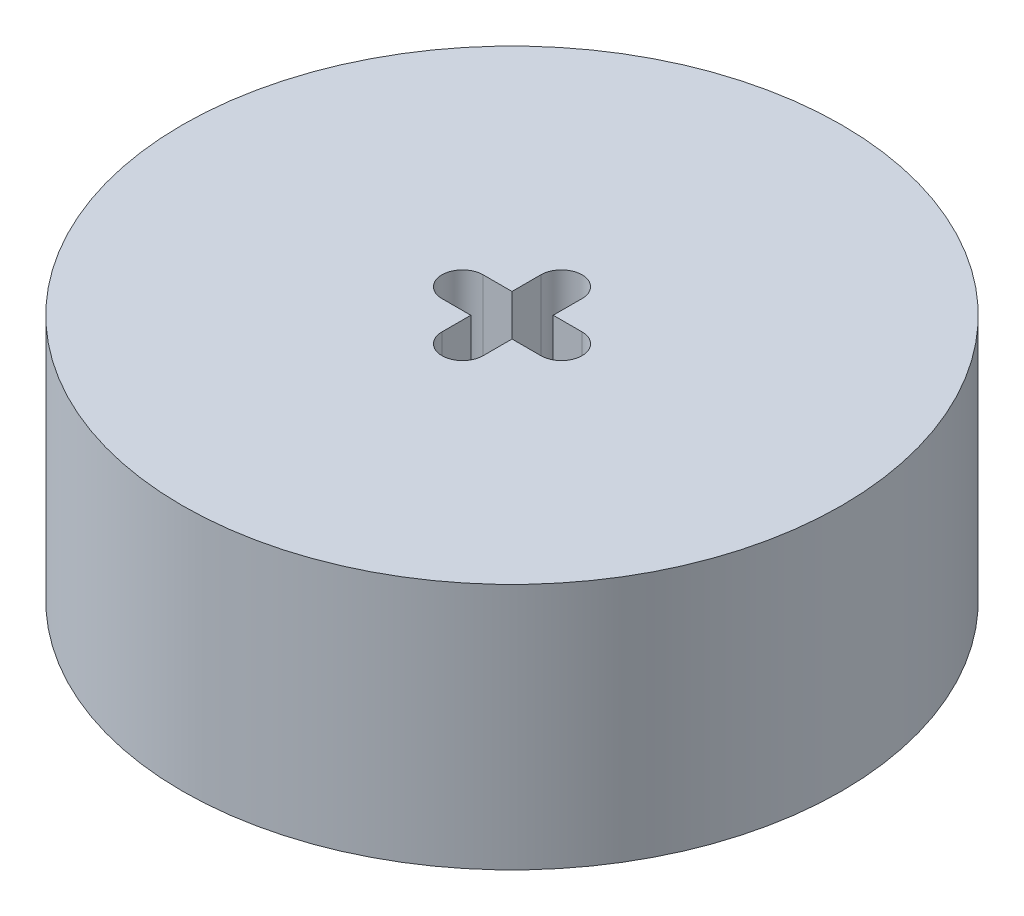
ISO-10303-21;
HEADER;
FILE_DESCRIPTION(('STEP AP214'),'2;1');
FILE_NAME('part.step','',(''),(''),'','','');
FILE_SCHEMA(('AUTOMOTIVE_DESIGN { 1 0 10303 214 1 1 1 1 }'));
ENDSEC;
DATA;
#1=APPLICATION_CONTEXT('core data for automotive mechanical design processes');
#2=APPLICATION_PROTOCOL_DEFINITION('international standard','automotive_design',2000,#1);
#3=PRODUCT_CONTEXT('',#1,'mechanical');
#4=PRODUCT('Part','Part','',(#3));
#5=PRODUCT_RELATED_PRODUCT_CATEGORY('part','',(#4));
#6=PRODUCT_DEFINITION_FORMATION('','',#4);
#7=PRODUCT_DEFINITION_CONTEXT('part definition',#1,'design');
#8=PRODUCT_DEFINITION('design','',#6,#7);
#9=PRODUCT_DEFINITION_SHAPE('','',#8);
#10=(LENGTH_UNIT() NAMED_UNIT(*) SI_UNIT(.MILLI.,.METRE.));
#11=(NAMED_UNIT(*) PLANE_ANGLE_UNIT() SI_UNIT($,.RADIAN.));
#12=(NAMED_UNIT(*) SI_UNIT($,.STERADIAN.) SOLID_ANGLE_UNIT());
#13=UNCERTAINTY_MEASURE_WITH_UNIT(LENGTH_MEASURE(1.E-05),#10,'distance_accuracy_value','');
#14=(GEOMETRIC_REPRESENTATION_CONTEXT(3) GLOBAL_UNCERTAINTY_ASSIGNED_CONTEXT((#13)) GLOBAL_UNIT_ASSIGNED_CONTEXT((#10,
#11,#12)) REPRESENTATION_CONTEXT('',''));
#15=CARTESIAN_POINT('',(0.,0.,0.));
#16=DIRECTION('',(0.,0.,1.));
#17=DIRECTION('',(1.,0.,0.));
#18=AXIS2_PLACEMENT_3D('',#15,#16,#17);
#19=CARTESIAN_POINT('',(0.,38.1,0.));
#20=DIRECTION('',(0.,1.,0.));
#21=DIRECTION('',(0.,0.,1.));
#22=AXIS2_PLACEMENT_3D('',#19,#20,#21);
#23=PLANE('',#22);
#24=DIRECTION('',(-1.,0.,0.));
#25=VECTOR('',#24,1.);
#26=CARTESIAN_POINT('',(0.,38.1,-3.17400000000062));
#27=LINE('',#26,#25);
#28=CARTESIAN_POINT('',(-3.175,38.1,-3.17400000000064));
#29=VERTEX_POINT('',#28);
#30=CARTESIAN_POINT('',(-7.61899999999997,38.1,-3.17400000000072));
#31=VERTEX_POINT('',#30);
#32=EDGE_CURVE('E54',#29,#31,#27,.T.);
#33=ORIENTED_EDGE('',*,*,#32,.F.);
#34=DIRECTION('',(0.,0.,-1.));
#35=VECTOR('',#34,1.);
#36=CARTESIAN_POINT('',(-3.175,38.1,0.));
#37=LINE('',#36,#35);
#38=CARTESIAN_POINT('',(-3.175,38.1,-7.62000000060629));
#39=VERTEX_POINT('',#38);
#40=EDGE_CURVE('E148',#29,#39,#37,.T.);
#41=ORIENTED_EDGE('',*,*,#40,.T.);
#42=CARTESIAN_POINT('',(0.,38.1,-7.62));
#43=DIRECTION('',(0.,1.,0.));
#44=DIRECTION('',(0.,0.,1.));
#45=AXIS2_PLACEMENT_3D('',#42,#43,#44);
#46=CIRCLE('',#45,3.175);
#47=CARTESIAN_POINT('',(3.175,38.1,-7.62));
#48=VERTEX_POINT('',#47);
#49=EDGE_CURVE('E154',#48,#39,#46,.T.);
#50=ORIENTED_EDGE('',*,*,#49,.F.);
#51=DIRECTION('',(0.,0.,-1.));
#52=VECTOR('',#51,1.);
#53=CARTESIAN_POINT('',(3.175,38.1,0.));
#54=LINE('',#53,#52);
#55=CARTESIAN_POINT('',(3.175,38.1,-3.17600000000064));
#56=VERTEX_POINT('',#55);
#57=EDGE_CURVE('E221',#56,#48,#54,.T.);
#58=ORIENTED_EDGE('',*,*,#57,.F.);
#59=DIRECTION('',(1.,0.,0.));
#60=VECTOR('',#59,1.);
#61=CARTESIAN_POINT('',(0.,38.1,-3.17600000000064));
#62=LINE('',#61,#60);
#63=CARTESIAN_POINT('',(7.62099999999846,38.1,-3.17600000000064));
#64=VERTEX_POINT('',#63);
#65=EDGE_CURVE('E217',#56,#64,#62,.T.);
#66=ORIENTED_EDGE('',*,*,#65,.T.);
#67=CARTESIAN_POINT('',(7.621,38.1,-0.00100000000063407));
#68=DIRECTION('',(0.,1.,0.));
#69=DIRECTION('',(0.,0.,1.));
#70=AXIS2_PLACEMENT_3D('',#67,#68,#69);
#71=CIRCLE('',#70,3.175);
#72=CARTESIAN_POINT('',(7.62099999999999,38.1,3.17399999999937));
#73=VERTEX_POINT('',#72);
#74=EDGE_CURVE('E213',#73,#64,#71,.T.);
#75=ORIENTED_EDGE('',*,*,#74,.F.);
#76=DIRECTION('',(1.,0.,0.));
#77=VECTOR('',#76,1.);
#78=CARTESIAN_POINT('',(0.,38.1,3.17399999999937));
#79=LINE('',#78,#77);
#80=CARTESIAN_POINT('',(3.17700000000044,38.1,3.17399999999937));
#81=VERTEX_POINT('',#80);
#82=EDGE_CURVE('E209',#81,#73,#79,.T.);
#83=ORIENTED_EDGE('',*,*,#82,.F.);
#84=DIRECTION('',(0.,0.,1.));
#85=VECTOR('',#84,1.);
#86=CARTESIAN_POINT('',(3.17700000000044,38.1,0.));
#87=LINE('',#86,#85);
#88=CARTESIAN_POINT('',(3.17700000000044,38.1,7.62000000000424));
#89=VERTEX_POINT('',#88);
#90=EDGE_CURVE('E205',#81,#89,#87,.T.);
#91=ORIENTED_EDGE('',*,*,#90,.T.);
#92=CARTESIAN_POINT('',(0.00200000000022201,38.1,7.62000000000179));
#93=DIRECTION('',(0.,1.,0.));
#94=DIRECTION('',(0.,0.,1.));
#95=AXIS2_PLACEMENT_3D('',#92,#93,#94);
#96=CIRCLE('',#95,3.17500000000022);
#97=CARTESIAN_POINT('',(-3.173,38.1,7.61999999999934));
#98=VERTEX_POINT('',#97);
#99=EDGE_CURVE('E202',#98,#89,#96,.T.);
#100=ORIENTED_EDGE('',*,*,#99,.F.);
#101=DIRECTION('',(0.,0.,1.));
#102=VECTOR('',#101,1.);
#103=CARTESIAN_POINT('',(-3.173,38.1,0.));
#104=LINE('',#103,#102);
#105=CARTESIAN_POINT('',(-3.173,38.1,3.17600000000064));
#106=VERTEX_POINT('',#105);
#107=EDGE_CURVE('E198',#106,#98,#104,.T.);
#108=ORIENTED_EDGE('',*,*,#107,.F.);
#109=DIRECTION('',(-1.,0.,0.));
#110=VECTOR('',#109,1.);
#111=CARTESIAN_POINT('',(0.,38.1,3.17600000000066));
#112=LINE('',#111,#110);
#113=CARTESIAN_POINT('',(-7.6190000000006,38.1,3.17600000000061));
#114=VERTEX_POINT('',#113);
#115=EDGE_CURVE('E194',#106,#114,#112,.T.);
#116=ORIENTED_EDGE('',*,*,#115,.T.);
#117=CARTESIAN_POINT('',(-7.619,38.1,0.000999999999920185));
#118=DIRECTION('',(0.,1.,0.));
#119=DIRECTION('',(0.,0.,1.));
#120=AXIS2_PLACEMENT_3D('',#117,#118,#119);
#121=CIRCLE('',#120,3.17500000000064);
#122=EDGE_CURVE('E191',#31,#114,#121,.T.);
#123=ORIENTED_EDGE('',*,*,#122,.F.);
#124=EDGE_LOOP('',(#33,#41,#50,#58,#66,#75,#83,#91,#100,#108,#116,#123));
#125=FACE_BOUND('',#124,.T.);
#126=CARTESIAN_POINT('',(0.,38.1,0.));
#127=DIRECTION('',(0.,1.,0.));
#128=DIRECTION('',(0.,0.,1.));
#129=AXIS2_PLACEMENT_3D('',#126,#127,#128);
#130=CIRCLE('',#129,50.8);
#131=CARTESIAN_POINT('',(0.,38.1,50.8));
#132=VERTEX_POINT('',#131);
#133=EDGE_CURVE('E11',#132,#132,#130,.T.);
#134=ORIENTED_EDGE('',*,*,#133,.T.);
#135=EDGE_LOOP('',(#134));
#136=FACE_BOUND('',#135,.T.);
#137=ADVANCED_FACE('F38',(#125,#136),#23,.T.);
#138=CARTESIAN_POINT('',(0.,0.,0.));
#139=DIRECTION('',(0.,1.,0.));
#140=DIRECTION('',(0.,0.,1.));
#141=AXIS2_PLACEMENT_3D('',#138,#139,#140);
#142=PLANE('',#141);
#143=DIRECTION('',(0.,0.,-1.));
#144=VECTOR('',#143,1.);
#145=CARTESIAN_POINT('',(-3.175,0.,0.));
#146=LINE('',#145,#144);
#147=CARTESIAN_POINT('',(-3.175,0.,-3.17400000000064));
#148=VERTEX_POINT('',#147);
#149=CARTESIAN_POINT('',(-3.175,0.,-7.62000000060629));
#150=VERTEX_POINT('',#149);
#151=EDGE_CURVE('E134',#148,#150,#146,.T.);
#152=ORIENTED_EDGE('',*,*,#151,.F.);
#153=DIRECTION('',(-1.,0.,0.));
#154=VECTOR('',#153,1.);
#155=CARTESIAN_POINT('',(0.,0.,-3.17400000000062));
#156=LINE('',#155,#154);
#157=CARTESIAN_POINT('',(-7.61899999999997,0.,-3.17400000000067));
#158=VERTEX_POINT('',#157);
#159=EDGE_CURVE('E130',#148,#158,#156,.T.);
#160=ORIENTED_EDGE('',*,*,#159,.T.);
#161=CARTESIAN_POINT('',(-7.619,0.,0.000999999999920185));
#162=DIRECTION('',(0.,1.,0.));
#163=DIRECTION('',(0.,0.,1.));
#164=AXIS2_PLACEMENT_3D('',#161,#162,#163);
#165=CIRCLE('',#164,3.17500000000064);
#166=CARTESIAN_POINT('',(-7.619,0.,3.17600000000056));
#167=VERTEX_POINT('',#166);
#168=EDGE_CURVE('E137',#158,#167,#165,.T.);
#169=ORIENTED_EDGE('',*,*,#168,.T.);
#170=DIRECTION('',(-1.,0.,0.));
#171=VECTOR('',#170,1.);
#172=CARTESIAN_POINT('',(0.,0.,3.17600000000066));
#173=LINE('',#172,#171);
#174=CARTESIAN_POINT('',(-3.173,0.,3.17600000000064));
#175=VERTEX_POINT('',#174);
#176=EDGE_CURVE('E142',#175,#167,#173,.T.);
#177=ORIENTED_EDGE('',*,*,#176,.F.);
#178=DIRECTION('',(0.,0.,1.));
#179=VECTOR('',#178,1.);
#180=CARTESIAN_POINT('',(-3.173,0.,0.));
#181=LINE('',#180,#179);
#182=CARTESIAN_POINT('',(-3.173,0.,7.61999999999934));
#183=VERTEX_POINT('',#182);
#184=EDGE_CURVE('E159',#175,#183,#181,.T.);
#185=ORIENTED_EDGE('',*,*,#184,.T.);
#186=CARTESIAN_POINT('',(0.00200000000022201,0.,7.62000000000179));
#187=DIRECTION('',(0.,1.,0.));
#188=DIRECTION('',(0.,0.,1.));
#189=AXIS2_PLACEMENT_3D('',#186,#187,#188);
#190=CIRCLE('',#189,3.17500000000022);
#191=CARTESIAN_POINT('',(3.17700000000044,0.,7.62000000000424));
#192=VERTEX_POINT('',#191);
#193=EDGE_CURVE('E163',#183,#192,#190,.T.);
#194=ORIENTED_EDGE('',*,*,#193,.T.);
#195=DIRECTION('',(0.,0.,1.));
#196=VECTOR('',#195,1.);
#197=CARTESIAN_POINT('',(3.17700000000044,0.,0.));
#198=LINE('',#197,#196);
#199=CARTESIAN_POINT('',(3.17700000000044,0.,3.17399999999937));
#200=VERTEX_POINT('',#199);
#201=EDGE_CURVE('E167',#200,#192,#198,.T.);
#202=ORIENTED_EDGE('',*,*,#201,.F.);
#203=DIRECTION('',(1.,0.,0.));
#204=VECTOR('',#203,1.);
#205=CARTESIAN_POINT('',(0.,0.,3.17399999999937));
#206=LINE('',#205,#204);
#207=CARTESIAN_POINT('',(7.62099999999999,0.,3.17399999999937));
#208=VERTEX_POINT('',#207);
#209=EDGE_CURVE('E170',#200,#208,#206,.T.);
#210=ORIENTED_EDGE('',*,*,#209,.T.);
#211=CARTESIAN_POINT('',(7.621,0.,-0.00100000000063407));
#212=DIRECTION('',(0.,1.,0.));
#213=DIRECTION('',(0.,0.,1.));
#214=AXIS2_PLACEMENT_3D('',#211,#212,#213);
#215=CIRCLE('',#214,3.175);
#216=CARTESIAN_POINT('',(7.62099999999846,0.,-3.17600000000064));
#217=VERTEX_POINT('',#216);
#218=EDGE_CURVE('E173',#208,#217,#215,.T.);
#219=ORIENTED_EDGE('',*,*,#218,.T.);
#220=DIRECTION('',(1.,0.,0.));
#221=VECTOR('',#220,1.);
#222=CARTESIAN_POINT('',(0.,0.,-3.17600000000064));
#223=LINE('',#222,#221);
#224=CARTESIAN_POINT('',(3.175,0.,-3.17600000000064));
#225=VERTEX_POINT('',#224);
#226=EDGE_CURVE('E177',#225,#217,#223,.T.);
#227=ORIENTED_EDGE('',*,*,#226,.F.);
#228=DIRECTION('',(0.,0.,-1.));
#229=VECTOR('',#228,1.);
#230=CARTESIAN_POINT('',(3.175,0.,0.));
#231=LINE('',#230,#229);
#232=CARTESIAN_POINT('',(3.175,0.,-7.62));
#233=VERTEX_POINT('',#232);
#234=EDGE_CURVE('E180',#225,#233,#231,.T.);
#235=ORIENTED_EDGE('',*,*,#234,.T.);
#236=CARTESIAN_POINT('',(0.,0.,-7.62));
#237=DIRECTION('',(0.,1.,0.));
#238=DIRECTION('',(0.,0.,1.));
#239=AXIS2_PLACEMENT_3D('',#236,#237,#238);
#240=CIRCLE('',#239,3.175);
#241=EDGE_CURVE('E184',#233,#150,#240,.T.);
#242=ORIENTED_EDGE('',*,*,#241,.T.);
#243=EDGE_LOOP('',(#152,#160,#169,#177,#185,#194,#202,#210,#219,#227,#235,#242));
#244=FACE_BOUND('',#243,.T.);
#245=CARTESIAN_POINT('',(0.,0.,0.));
#246=DIRECTION('',(0.,1.,0.));
#247=DIRECTION('',(0.,0.,1.));
#248=AXIS2_PLACEMENT_3D('',#245,#246,#247);
#249=CIRCLE('',#248,50.8);
#250=CARTESIAN_POINT('',(0.,0.,50.8));
#251=VERTEX_POINT('',#250);
#252=EDGE_CURVE('E42',#251,#251,#249,.T.);
#253=ORIENTED_EDGE('',*,*,#252,.F.);
#254=EDGE_LOOP('',(#253));
#255=FACE_BOUND('',#254,.T.);
#256=ADVANCED_FACE('F144',(#244,#255),#142,.F.);
#257=CARTESIAN_POINT('',(0.,38.1,0.));
#258=DIRECTION('',(0.,-1.,0.));
#259=DIRECTION('',(0.,0.,-1.));
#260=AXIS2_PLACEMENT_3D('',#257,#258,#259);
#261=CYLINDRICAL_SURFACE('',#260,50.8);
#262=ORIENTED_EDGE('',*,*,#133,.F.);
#263=EDGE_LOOP('',(#262));
#264=FACE_BOUND('',#263,.T.);
#265=ORIENTED_EDGE('',*,*,#252,.T.);
#266=EDGE_LOOP('',(#265));
#267=FACE_BOUND('',#266,.T.);
#268=ADVANCED_FACE('F40',(#264,#267),#261,.T.);
#269=CARTESIAN_POINT('',(0.,0.,-3.17400000000062));
#270=DIRECTION('',(0.,0.,-1.));
#271=DIRECTION('',(-1.,0.,0.));
#272=AXIS2_PLACEMENT_3D('',#269,#270,#271);
#273=PLANE('',#272);
#274=ORIENTED_EDGE('',*,*,#32,.T.);
#275=DIRECTION('',(0.,1.,0.));
#276=VECTOR('',#275,1.);
#277=CARTESIAN_POINT('',(-7.61899999999997,0.,-3.17400000000067));
#278=LINE('',#277,#276);
#279=EDGE_CURVE('E127',#158,#31,#278,.T.);
#280=ORIENTED_EDGE('',*,*,#279,.F.);
#281=ORIENTED_EDGE('',*,*,#159,.F.);
#282=DIRECTION('',(0.,1.,0.));
#283=VECTOR('',#282,1.);
#284=CARTESIAN_POINT('',(-3.175,0.,-3.17400000000064));
#285=LINE('',#284,#283);
#286=EDGE_CURVE('E228',#148,#29,#285,.T.);
#287=ORIENTED_EDGE('',*,*,#286,.T.);
#288=EDGE_LOOP('',(#274,#280,#281,#287));
#289=FACE_BOUND('',#288,.T.);
#290=ADVANCED_FACE('F128',(#289),#273,.F.);
#291=CARTESIAN_POINT('',(-3.175,0.,0.));
#292=DIRECTION('',(1.,0.,0.));
#293=DIRECTION('',(0.,0.,-1.));
#294=AXIS2_PLACEMENT_3D('',#291,#292,#293);
#295=PLANE('',#294);
#296=ORIENTED_EDGE('',*,*,#40,.F.);
#297=ORIENTED_EDGE('',*,*,#286,.F.);
#298=ORIENTED_EDGE('',*,*,#151,.T.);
#299=DIRECTION('',(0.,1.,0.));
#300=VECTOR('',#299,1.);
#301=CARTESIAN_POINT('',(-3.175,0.,-7.62000000060629));
#302=LINE('',#301,#300);
#303=EDGE_CURVE('E231',#150,#39,#302,.T.);
#304=ORIENTED_EDGE('',*,*,#303,.T.);
#305=EDGE_LOOP('',(#296,#297,#298,#304));
#306=FACE_BOUND('',#305,.T.);
#307=ADVANCED_FACE('F301',(#306),#295,.T.);
#308=CARTESIAN_POINT('',(0.,0.,-7.62));
#309=DIRECTION('',(0.,1.,0.));
#310=DIRECTION('',(0.,0.,1.));
#311=AXIS2_PLACEMENT_3D('',#308,#309,#310);
#312=CYLINDRICAL_SURFACE('',#311,3.175);
#313=ORIENTED_EDGE('',*,*,#49,.T.);
#314=ORIENTED_EDGE('',*,*,#303,.F.);
#315=ORIENTED_EDGE('',*,*,#241,.F.);
#316=DIRECTION('',(0.,1.,0.));
#317=VECTOR('',#316,1.);
#318=CARTESIAN_POINT('',(3.175,0.,-7.62));
#319=LINE('',#318,#317);
#320=EDGE_CURVE('E234',#233,#48,#319,.T.);
#321=ORIENTED_EDGE('',*,*,#320,.T.);
#322=EDGE_LOOP('',(#313,#314,#315,#321));
#323=FACE_BOUND('',#322,.T.);
#324=ADVANCED_FACE('F297',(#323),#312,.F.);
#325=CARTESIAN_POINT('',(3.175,0.,0.));
#326=DIRECTION('',(1.,0.,0.));
#327=DIRECTION('',(0.,0.,-1.));
#328=AXIS2_PLACEMENT_3D('',#325,#326,#327);
#329=PLANE('',#328);
#330=ORIENTED_EDGE('',*,*,#57,.T.);
#331=ORIENTED_EDGE('',*,*,#320,.F.);
#332=ORIENTED_EDGE('',*,*,#234,.F.);
#333=DIRECTION('',(0.,1.,0.));
#334=VECTOR('',#333,1.);
#335=CARTESIAN_POINT('',(3.175,0.,-3.17600000000064));
#336=LINE('',#335,#334);
#337=EDGE_CURVE('E237',#225,#56,#336,.T.);
#338=ORIENTED_EDGE('',*,*,#337,.T.);
#339=EDGE_LOOP('',(#330,#331,#332,#338));
#340=FACE_BOUND('',#339,.T.);
#341=ADVANCED_FACE('F293',(#340),#329,.F.);
#342=CARTESIAN_POINT('',(0.,0.,-3.17600000000064));
#343=DIRECTION('',(0.,0.,1.));
#344=DIRECTION('',(1.,0.,0.));
#345=AXIS2_PLACEMENT_3D('',#342,#343,#344);
#346=PLANE('',#345);
#347=ORIENTED_EDGE('',*,*,#65,.F.);
#348=ORIENTED_EDGE('',*,*,#337,.F.);
#349=ORIENTED_EDGE('',*,*,#226,.T.);
#350=DIRECTION('',(0.,1.,0.));
#351=VECTOR('',#350,1.);
#352=CARTESIAN_POINT('',(7.62099999999846,0.,-3.17600000000064));
#353=LINE('',#352,#351);
#354=EDGE_CURVE('E240',#217,#64,#353,.T.);
#355=ORIENTED_EDGE('',*,*,#354,.T.);
#356=EDGE_LOOP('',(#347,#348,#349,#355));
#357=FACE_BOUND('',#356,.T.);
#358=ADVANCED_FACE('F289',(#357),#346,.T.);
#359=CARTESIAN_POINT('',(7.621,0.,-0.00100000000063407));
#360=DIRECTION('',(0.,1.,0.));
#361=DIRECTION('',(0.,0.,1.));
#362=AXIS2_PLACEMENT_3D('',#359,#360,#361);
#363=CYLINDRICAL_SURFACE('',#362,3.175);
#364=ORIENTED_EDGE('',*,*,#74,.T.);
#365=ORIENTED_EDGE('',*,*,#354,.F.);
#366=ORIENTED_EDGE('',*,*,#218,.F.);
#367=DIRECTION('',(0.,1.,0.));
#368=VECTOR('',#367,1.);
#369=CARTESIAN_POINT('',(7.62099999999999,0.,3.17399999999937));
#370=LINE('',#369,#368);
#371=EDGE_CURVE('E243',#208,#73,#370,.T.);
#372=ORIENTED_EDGE('',*,*,#371,.T.);
#373=EDGE_LOOP('',(#364,#365,#366,#372));
#374=FACE_BOUND('',#373,.T.);
#375=ADVANCED_FACE('F285',(#374),#363,.F.);
#376=CARTESIAN_POINT('',(0.,0.,3.17399999999937));
#377=DIRECTION('',(0.,0.,1.));
#378=DIRECTION('',(1.,0.,0.));
#379=AXIS2_PLACEMENT_3D('',#376,#377,#378);
#380=PLANE('',#379);
#381=ORIENTED_EDGE('',*,*,#82,.T.);
#382=ORIENTED_EDGE('',*,*,#371,.F.);
#383=ORIENTED_EDGE('',*,*,#209,.F.);
#384=DIRECTION('',(0.,1.,0.));
#385=VECTOR('',#384,1.);
#386=CARTESIAN_POINT('',(3.17700000000044,0.,3.17399999999937));
#387=LINE('',#386,#385);
#388=EDGE_CURVE('E246',#200,#81,#387,.T.);
#389=ORIENTED_EDGE('',*,*,#388,.T.);
#390=EDGE_LOOP('',(#381,#382,#383,#389));
#391=FACE_BOUND('',#390,.T.);
#392=ADVANCED_FACE('F280',(#391),#380,.F.);
#393=CARTESIAN_POINT('',(3.17700000000044,0.,0.));
#394=DIRECTION('',(-1.,0.,0.));
#395=DIRECTION('',(0.,0.,1.));
#396=AXIS2_PLACEMENT_3D('',#393,#394,#395);
#397=PLANE('',#396);
#398=ORIENTED_EDGE('',*,*,#90,.F.);
#399=ORIENTED_EDGE('',*,*,#388,.F.);
#400=ORIENTED_EDGE('',*,*,#201,.T.);
#401=DIRECTION('',(0.,1.,0.));
#402=VECTOR('',#401,1.);
#403=CARTESIAN_POINT('',(3.17700000000044,0.,7.62000000000424));
#404=LINE('',#403,#402);
#405=EDGE_CURVE('E249',#192,#89,#404,.T.);
#406=ORIENTED_EDGE('',*,*,#405,.T.);
#407=EDGE_LOOP('',(#398,#399,#400,#406));
#408=FACE_BOUND('',#407,.T.);
#409=ADVANCED_FACE('F276',(#408),#397,.T.);
#410=CARTESIAN_POINT('',(0.00200000000022201,0.,7.62000000000179));
#411=DIRECTION('',(0.,1.,0.));
#412=DIRECTION('',(0.,0.,1.));
#413=AXIS2_PLACEMENT_3D('',#410,#411,#412);
#414=CYLINDRICAL_SURFACE('',#413,3.17500000000022);
#415=ORIENTED_EDGE('',*,*,#99,.T.);
#416=ORIENTED_EDGE('',*,*,#405,.F.);
#417=ORIENTED_EDGE('',*,*,#193,.F.);
#418=DIRECTION('',(0.,1.,0.));
#419=VECTOR('',#418,1.);
#420=CARTESIAN_POINT('',(-3.173,0.,7.61999999999934));
#421=LINE('',#420,#419);
#422=EDGE_CURVE('E252',#183,#98,#421,.T.);
#423=ORIENTED_EDGE('',*,*,#422,.T.);
#424=EDGE_LOOP('',(#415,#416,#417,#423));
#425=FACE_BOUND('',#424,.T.);
#426=ADVANCED_FACE('F273',(#425),#414,.F.);
#427=CARTESIAN_POINT('',(-3.173,0.,0.));
#428=DIRECTION('',(-1.,0.,0.));
#429=DIRECTION('',(0.,0.,1.));
#430=AXIS2_PLACEMENT_3D('',#427,#428,#429);
#431=PLANE('',#430);
#432=ORIENTED_EDGE('',*,*,#107,.T.);
#433=ORIENTED_EDGE('',*,*,#422,.F.);
#434=ORIENTED_EDGE('',*,*,#184,.F.);
#435=DIRECTION('',(0.,1.,0.));
#436=VECTOR('',#435,1.);
#437=CARTESIAN_POINT('',(-3.173,0.,3.17600000000064));
#438=LINE('',#437,#436);
#439=EDGE_CURVE('E255',#175,#106,#438,.T.);
#440=ORIENTED_EDGE('',*,*,#439,.T.);
#441=EDGE_LOOP('',(#432,#433,#434,#440));
#442=FACE_BOUND('',#441,.T.);
#443=ADVANCED_FACE('F267',(#442),#431,.F.);
#444=CARTESIAN_POINT('',(0.,0.,3.17600000000066));
#445=DIRECTION('',(0.,0.,-1.));
#446=DIRECTION('',(-1.,0.,0.));
#447=AXIS2_PLACEMENT_3D('',#444,#445,#446);
#448=PLANE('',#447);
#449=ORIENTED_EDGE('',*,*,#115,.F.);
#450=ORIENTED_EDGE('',*,*,#439,.F.);
#451=ORIENTED_EDGE('',*,*,#176,.T.);
#452=DIRECTION('',(0.,1.,0.));
#453=VECTOR('',#452,1.);
#454=CARTESIAN_POINT('',(-7.6190000000006,0.,3.17600000000061));
#455=LINE('',#454,#453);
#456=EDGE_CURVE('E62',#167,#114,#455,.T.);
#457=ORIENTED_EDGE('',*,*,#456,.T.);
#458=EDGE_LOOP('',(#449,#450,#451,#457));
#459=FACE_BOUND('',#458,.T.);
#460=ADVANCED_FACE('F261',(#459),#448,.T.);
#461=CARTESIAN_POINT('',(-7.619,0.,0.000999999999920185));
#462=DIRECTION('',(0.,1.,0.));
#463=DIRECTION('',(0.,0.,1.));
#464=AXIS2_PLACEMENT_3D('',#461,#462,#463);
#465=CYLINDRICAL_SURFACE('',#464,3.17500000000064);
#466=ORIENTED_EDGE('',*,*,#122,.T.);
#467=ORIENTED_EDGE('',*,*,#456,.F.);
#468=ORIENTED_EDGE('',*,*,#168,.F.);
#469=ORIENTED_EDGE('',*,*,#279,.T.);
#470=EDGE_LOOP('',(#466,#467,#468,#469));
#471=FACE_BOUND('',#470,.T.);
#472=ADVANCED_FACE('F138',(#471),#465,.F.);
#473=CLOSED_SHELL('',(#137,#256,#268,#290,#307,#324,#341,#358,#375,#392,#409,#426,#443,#460,#472));
#474=MANIFOLD_SOLID_BREP('B2',#473);
#475=ADVANCED_BREP_SHAPE_REPRESENTATION('',(#18,#474),#14);
#476=SHAPE_DEFINITION_REPRESENTATION(#9,#475);
ENDSEC;
END-ISO-10303-21;
